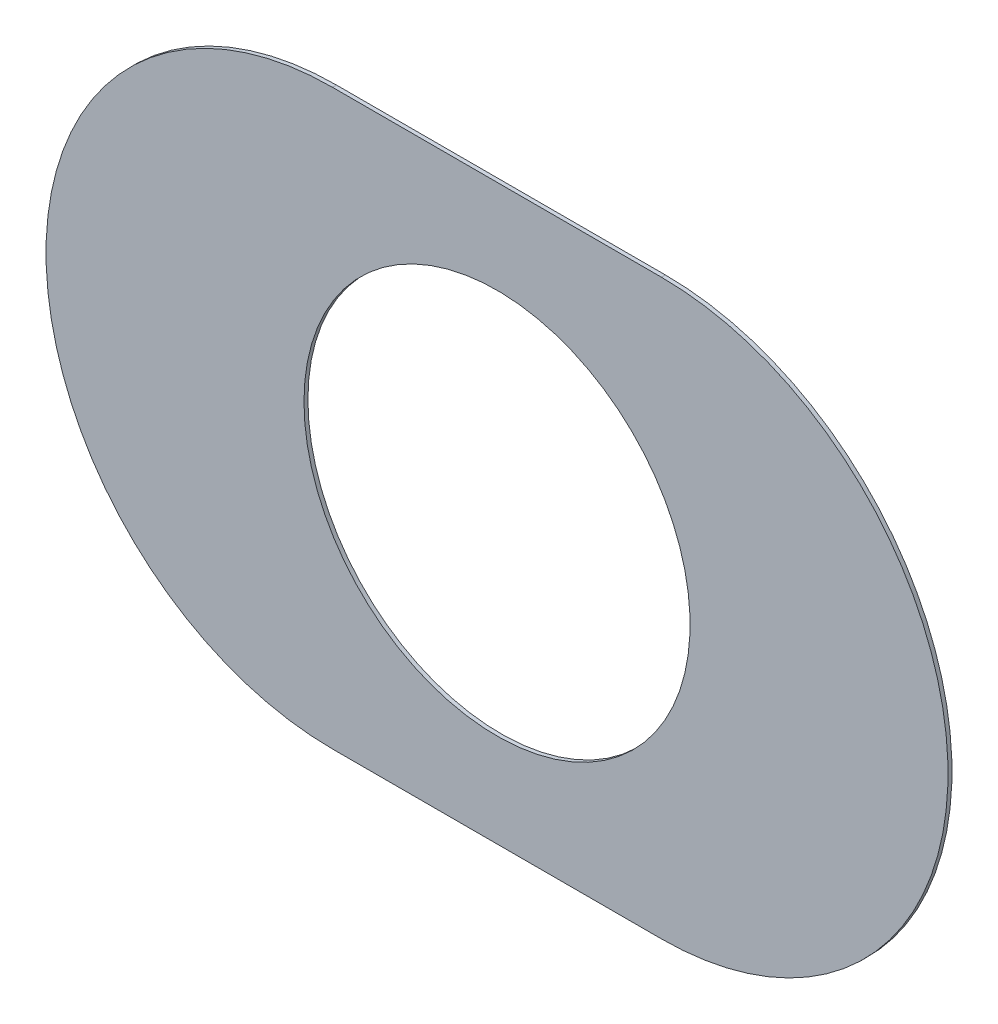
ISO-10303-21;
HEADER;
FILE_DESCRIPTION(('STEP AP214'),'2;1');
FILE_NAME('part.step','',(''),(''),'','','');
FILE_SCHEMA(('AUTOMOTIVE_DESIGN { 1 0 10303 214 1 1 1 1 }'));
ENDSEC;
DATA;
#1=APPLICATION_CONTEXT('core data for automotive mechanical design processes');
#2=APPLICATION_PROTOCOL_DEFINITION('international standard','automotive_design',2000,#1);
#3=PRODUCT_CONTEXT('',#1,'mechanical');
#4=PRODUCT('Part','Part','',(#3));
#5=PRODUCT_RELATED_PRODUCT_CATEGORY('part','',(#4));
#6=PRODUCT_DEFINITION_FORMATION('','',#4);
#7=PRODUCT_DEFINITION_CONTEXT('part definition',#1,'design');
#8=PRODUCT_DEFINITION('design','',#6,#7);
#9=PRODUCT_DEFINITION_SHAPE('','',#8);
#10=(LENGTH_UNIT() NAMED_UNIT(*) SI_UNIT(.MILLI.,.METRE.));
#11=(NAMED_UNIT(*) PLANE_ANGLE_UNIT() SI_UNIT($,.RADIAN.));
#12=(NAMED_UNIT(*) SI_UNIT($,.STERADIAN.) SOLID_ANGLE_UNIT());
#13=UNCERTAINTY_MEASURE_WITH_UNIT(LENGTH_MEASURE(1.E-05),#10,'distance_accuracy_value','');
#14=(GEOMETRIC_REPRESENTATION_CONTEXT(3) GLOBAL_UNCERTAINTY_ASSIGNED_CONTEXT((#13)) GLOBAL_UNIT_ASSIGNED_CONTEXT((#10,
#11,#12)) REPRESENTATION_CONTEXT('',''));
#15=CARTESIAN_POINT('',(0.,0.,0.));
#16=DIRECTION('',(0.,0.,1.));
#17=DIRECTION('',(1.,0.,0.));
#18=AXIS2_PLACEMENT_3D('',#15,#16,#17);
#19=CARTESIAN_POINT('',(1.54999965727325,29.7800006854535,0.));
#20=DIRECTION('',(0.,0.,-1.));
#21=DIRECTION('',(0.,-1.,0.));
#22=AXIS2_PLACEMENT_3D('',#19,#20,#21);
#23=PLANE('',#22);
#24=CARTESIAN_POINT('',(1.54999965727325,29.7800006854535,0.));
#25=DIRECTION('',(0.,0.,1.));
#26=DIRECTION('',(1.,0.,0.));
#27=AXIS2_PLACEMENT_3D('',#24,#25,#26);
#28=CIRCLE('',#27,0.49);
#29=CARTESIAN_POINT('',(1.05999965727325,29.7800006854535,0.));
#30=VERTEX_POINT('',#29);
#31=EDGE_CURVE('E103',#30,#30,#28,.T.);
#32=ORIENTED_EDGE('',*,*,#31,.F.);
#33=EDGE_LOOP('',(#32));
#34=FACE_BOUND('',#33,.T.);
#35=CARTESIAN_POINT('',(1.96740611181985,29.7800006854535,0.));
#36=DIRECTION('',(0.,0.,-1.));
#37=DIRECTION('',(0.,1.,0.));
#38=AXIS2_PLACEMENT_3D('',#35,#36,#37);
#39=CIRCLE('',#38,0.727257121659981);
#40=CARTESIAN_POINT('',(1.96740611181985,30.5072578071135,0.));
#41=VERTEX_POINT('',#40);
#42=CARTESIAN_POINT('',(1.96740611181985,29.0527435637935,0.));
#43=VERTEX_POINT('',#42);
#44=EDGE_CURVE('E28',#41,#43,#39,.T.);
#45=ORIENTED_EDGE('',*,*,#44,.F.);
#46=DIRECTION('',(1.,0.,0.));
#47=VECTOR('',#46,1.);
#48=CARTESIAN_POINT('',(1.13259320272665,30.5072578071135,0.));
#49=LINE('',#48,#47);
#50=CARTESIAN_POINT('',(1.13259320272665,30.5072578071135,0.));
#51=VERTEX_POINT('',#50);
#52=EDGE_CURVE('E85',#51,#41,#49,.T.);
#53=ORIENTED_EDGE('',*,*,#52,.F.);
#54=CARTESIAN_POINT('',(1.13259320272665,29.7800006854535,0.));
#55=DIRECTION('',(0.,0.,-1.));
#56=DIRECTION('',(0.,-1.,0.));
#57=AXIS2_PLACEMENT_3D('',#54,#55,#56);
#58=CIRCLE('',#57,0.727257121659981);
#59=CARTESIAN_POINT('',(1.13259320272665,29.0527435637935,0.));
#60=VERTEX_POINT('',#59);
#61=EDGE_CURVE('E75',#60,#51,#58,.T.);
#62=ORIENTED_EDGE('',*,*,#61,.F.);
#63=DIRECTION('',(-1.,0.,0.));
#64=VECTOR('',#63,1.);
#65=CARTESIAN_POINT('',(1.96740611181985,29.0527435637935,0.));
#66=LINE('',#65,#64);
#67=EDGE_CURVE('E86',#43,#60,#66,.T.);
#68=ORIENTED_EDGE('',*,*,#67,.F.);
#69=EDGE_LOOP('',(#45,#53,#62,#68));
#70=FACE_BOUND('',#69,.T.);
#71=ADVANCED_FACE('F17',(#34,#70),#23,.F.);
#72=CARTESIAN_POINT('',(1.54999965727325,29.7800006854535,-0.01));
#73=DIRECTION('',(0.,0.,-1.));
#74=DIRECTION('',(0.,-1.,0.));
#75=AXIS2_PLACEMENT_3D('',#72,#73,#74);
#76=PLANE('',#75);
#77=CARTESIAN_POINT('',(1.54999965727325,29.7800006854535,-0.01));
#78=DIRECTION('',(0.,0.,1.));
#79=DIRECTION('',(1.,0.,0.));
#80=AXIS2_PLACEMENT_3D('',#77,#78,#79);
#81=CIRCLE('',#80,0.49);
#82=CARTESIAN_POINT('',(1.05999965727325,29.7800006854535,-0.01));
#83=VERTEX_POINT('',#82);
#84=EDGE_CURVE('E131',#83,#83,#81,.T.);
#85=ORIENTED_EDGE('',*,*,#84,.T.);
#86=EDGE_LOOP('',(#85));
#87=FACE_BOUND('',#86,.T.);
#88=CARTESIAN_POINT('',(1.96740611181985,29.7800006854535,-0.01));
#89=DIRECTION('',(0.,0.,-1.));
#90=DIRECTION('',(0.,1.,0.));
#91=AXIS2_PLACEMENT_3D('',#88,#89,#90);
#92=CIRCLE('',#91,0.727257121659981);
#93=CARTESIAN_POINT('',(1.96740611181985,30.5072578071135,-0.01));
#94=VERTEX_POINT('',#93);
#95=CARTESIAN_POINT('',(1.96740611181985,29.0527435637935,-0.01));
#96=VERTEX_POINT('',#95);
#97=EDGE_CURVE('E11',#94,#96,#92,.T.);
#98=ORIENTED_EDGE('',*,*,#97,.T.);
#99=DIRECTION('',(-1.,0.,0.));
#100=VECTOR('',#99,1.);
#101=CARTESIAN_POINT('',(1.96740611181985,29.0527435637935,-0.01));
#102=LINE('',#101,#100);
#103=CARTESIAN_POINT('',(1.13259320272665,29.0527435637935,-0.01));
#104=VERTEX_POINT('',#103);
#105=EDGE_CURVE('E120',#96,#104,#102,.T.);
#106=ORIENTED_EDGE('',*,*,#105,.T.);
#107=CARTESIAN_POINT('',(1.13259320272665,29.7800006854535,-0.01));
#108=DIRECTION('',(0.,0.,-1.));
#109=DIRECTION('',(0.,-1.,0.));
#110=AXIS2_PLACEMENT_3D('',#107,#108,#109);
#111=CIRCLE('',#110,0.727257121659981);
#112=CARTESIAN_POINT('',(1.13259320272665,30.5072578071135,-0.01));
#113=VERTEX_POINT('',#112);
#114=EDGE_CURVE('E113',#104,#113,#111,.T.);
#115=ORIENTED_EDGE('',*,*,#114,.T.);
#116=DIRECTION('',(1.,0.,0.));
#117=VECTOR('',#116,1.);
#118=CARTESIAN_POINT('',(1.13259320272665,30.5072578071135,-0.01));
#119=LINE('',#118,#117);
#120=EDGE_CURVE('E98',#113,#94,#119,.T.);
#121=ORIENTED_EDGE('',*,*,#120,.T.);
#122=EDGE_LOOP('',(#98,#106,#115,#121));
#123=FACE_BOUND('',#122,.T.);
#124=ADVANCED_FACE('F138',(#87,#123),#76,.T.);
#125=CARTESIAN_POINT('',(1.96740611181985,29.7800006854535,0.));
#126=DIRECTION('',(0.,0.,-1.));
#127=DIRECTION('',(0.,1.,0.));
#128=AXIS2_PLACEMENT_3D('',#125,#126,#127);
#129=CYLINDRICAL_SURFACE('',#128,0.727257121659981);
#130=ORIENTED_EDGE('',*,*,#44,.T.);
#131=DIRECTION('',(0.,0.,-1.));
#132=VECTOR('',#131,1.);
#133=CARTESIAN_POINT('',(1.96740611181985,29.0527435637935,0.));
#134=LINE('',#133,#132);
#135=EDGE_CURVE('E90',#43,#96,#134,.T.);
#136=ORIENTED_EDGE('',*,*,#135,.T.);
#137=ORIENTED_EDGE('',*,*,#97,.F.);
#138=DIRECTION('',(0.,0.,-1.));
#139=VECTOR('',#138,1.);
#140=CARTESIAN_POINT('',(1.96740611181985,30.5072578071135,0.));
#141=LINE('',#140,#139);
#142=EDGE_CURVE('E93',#41,#94,#141,.T.);
#143=ORIENTED_EDGE('',*,*,#142,.F.);
#144=EDGE_LOOP('',(#130,#136,#137,#143));
#145=FACE_BOUND('',#144,.T.);
#146=ADVANCED_FACE('F94',(#145),#129,.T.);
#147=CARTESIAN_POINT('',(1.96740611181985,29.0527435637935,0.));
#148=DIRECTION('',(0.,-1.,0.));
#149=DIRECTION('',(0.,0.,-1.));
#150=AXIS2_PLACEMENT_3D('',#147,#148,#149);
#151=PLANE('',#150);
#152=ORIENTED_EDGE('',*,*,#67,.T.);
#153=DIRECTION('',(0.,0.,-1.));
#154=VECTOR('',#153,1.);
#155=CARTESIAN_POINT('',(1.13259320272665,29.0527435637935,0.));
#156=LINE('',#155,#154);
#157=EDGE_CURVE('E114',#60,#104,#156,.T.);
#158=ORIENTED_EDGE('',*,*,#157,.T.);
#159=ORIENTED_EDGE('',*,*,#105,.F.);
#160=ORIENTED_EDGE('',*,*,#135,.F.);
#161=EDGE_LOOP('',(#152,#158,#159,#160));
#162=FACE_BOUND('',#161,.T.);
#163=ADVANCED_FACE('F19',(#162),#151,.T.);
#164=CARTESIAN_POINT('',(1.13259320272665,29.7800006854535,0.));
#165=DIRECTION('',(0.,0.,-1.));
#166=DIRECTION('',(0.,-1.,0.));
#167=AXIS2_PLACEMENT_3D('',#164,#165,#166);
#168=CYLINDRICAL_SURFACE('',#167,0.727257121659981);
#169=ORIENTED_EDGE('',*,*,#61,.T.);
#170=DIRECTION('',(0.,0.,-1.));
#171=VECTOR('',#170,1.);
#172=CARTESIAN_POINT('',(1.13259320272665,30.5072578071135,0.));
#173=LINE('',#172,#171);
#174=EDGE_CURVE('E101',#51,#113,#173,.T.);
#175=ORIENTED_EDGE('',*,*,#174,.T.);
#176=ORIENTED_EDGE('',*,*,#114,.F.);
#177=ORIENTED_EDGE('',*,*,#157,.F.);
#178=EDGE_LOOP('',(#169,#175,#176,#177));
#179=FACE_BOUND('',#178,.T.);
#180=ADVANCED_FACE('F139',(#179),#168,.T.);
#181=CARTESIAN_POINT('',(1.13259320272665,30.5072578071135,0.));
#182=DIRECTION('',(0.,1.,0.));
#183=DIRECTION('',(1.,0.,0.));
#184=AXIS2_PLACEMENT_3D('',#181,#182,#183);
#185=PLANE('',#184);
#186=ORIENTED_EDGE('',*,*,#52,.T.);
#187=ORIENTED_EDGE('',*,*,#142,.T.);
#188=ORIENTED_EDGE('',*,*,#120,.F.);
#189=ORIENTED_EDGE('',*,*,#174,.F.);
#190=EDGE_LOOP('',(#186,#187,#188,#189));
#191=FACE_BOUND('',#190,.T.);
#192=ADVANCED_FACE('F100',(#191),#185,.T.);
#193=CARTESIAN_POINT('',(1.54999965727325,29.7800006854535,0.));
#194=DIRECTION('',(0.,0.,-1.));
#195=DIRECTION('',(1.,0.,0.));
#196=AXIS2_PLACEMENT_3D('',#193,#194,#195);
#197=CYLINDRICAL_SURFACE('',#196,0.49);
#198=ORIENTED_EDGE('',*,*,#84,.F.);
#199=DIRECTION('',(0.,0.,1.));
#200=VECTOR('',#199,1.);
#201=CARTESIAN_POINT('',(1.05999965727325,29.7800006854535,0.));
#202=LINE('',#201,#200);
#203=EDGE_CURVE('E21',#83,#30,#202,.T.);
#204=ORIENTED_EDGE('',*,*,#203,.T.);
#205=ORIENTED_EDGE('',*,*,#31,.T.);
#206=ORIENTED_EDGE('',*,*,#203,.F.);
#207=EDGE_LOOP('',(#198,#204,#205,#206));
#208=FACE_BOUND('',#207,.T.);
#209=ADVANCED_FACE('F159',(#208),#197,.F.);
#210=CLOSED_SHELL('',(#71,#124,#146,#163,#180,#192,#209));
#211=MANIFOLD_SOLID_BREP('B1',#210);
#212=ADVANCED_BREP_SHAPE_REPRESENTATION('',(#18,#211),#14);
#213=SHAPE_DEFINITION_REPRESENTATION(#9,#212);
ENDSEC;
END-ISO-10303-21;
